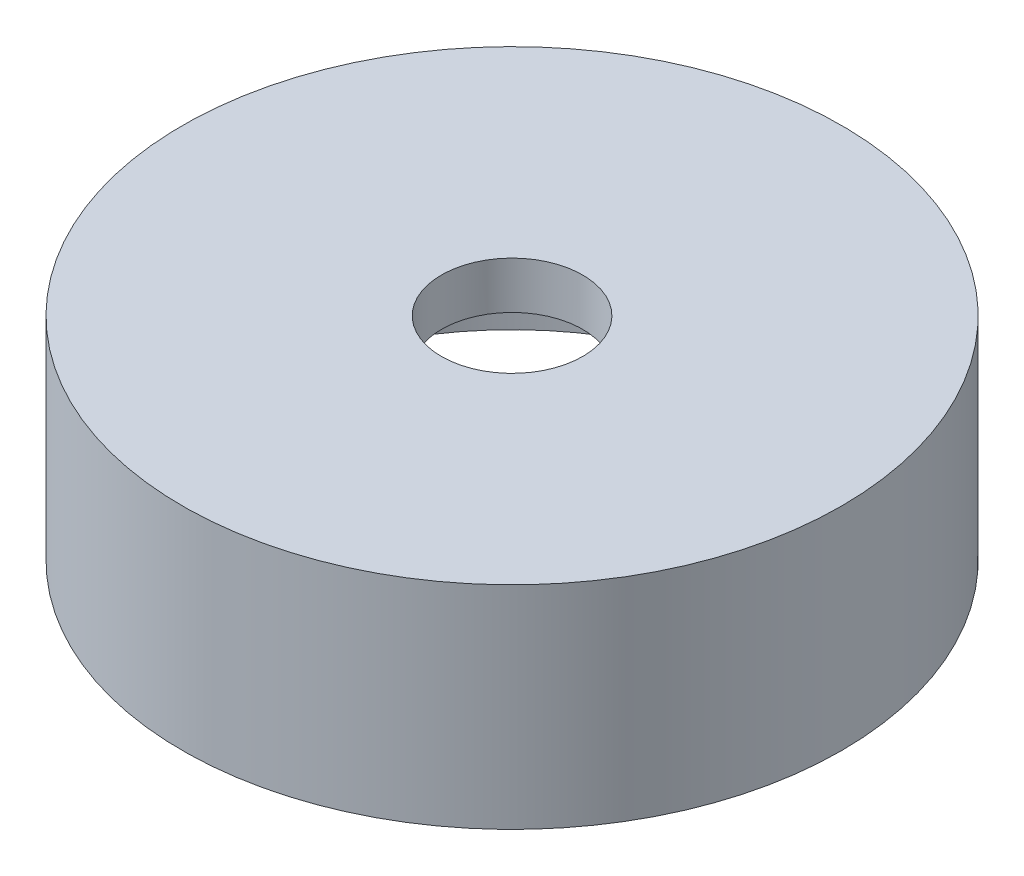
ISO-10303-21;
HEADER;
FILE_DESCRIPTION(('STEP AP214'),'2;1');
FILE_NAME('part.step','',(''),(''),'','','');
FILE_SCHEMA(('AUTOMOTIVE_DESIGN { 1 0 10303 214 1 1 1 1 }'));
ENDSEC;
DATA;
#1=APPLICATION_CONTEXT('core data for automotive mechanical design processes');
#2=APPLICATION_PROTOCOL_DEFINITION('international standard','automotive_design',2000,#1);
#3=PRODUCT_CONTEXT('',#1,'mechanical');
#4=PRODUCT('Part','Part','',(#3));
#5=PRODUCT_RELATED_PRODUCT_CATEGORY('part','',(#4));
#6=PRODUCT_DEFINITION_FORMATION('','',#4);
#7=PRODUCT_DEFINITION_CONTEXT('part definition',#1,'design');
#8=PRODUCT_DEFINITION('design','',#6,#7);
#9=PRODUCT_DEFINITION_SHAPE('','',#8);
#10=(LENGTH_UNIT() NAMED_UNIT(*) SI_UNIT(.MILLI.,.METRE.));
#11=(NAMED_UNIT(*) PLANE_ANGLE_UNIT() SI_UNIT($,.RADIAN.));
#12=(NAMED_UNIT(*) SI_UNIT($,.STERADIAN.) SOLID_ANGLE_UNIT());
#13=UNCERTAINTY_MEASURE_WITH_UNIT(LENGTH_MEASURE(1.E-05),#10,'distance_accuracy_value','');
#14=(GEOMETRIC_REPRESENTATION_CONTEXT(3) GLOBAL_UNCERTAINTY_ASSIGNED_CONTEXT((#13)) GLOBAL_UNIT_ASSIGNED_CONTEXT((#10,
#11,#12)) REPRESENTATION_CONTEXT('',''));
#15=CARTESIAN_POINT('',(0.,0.,0.));
#16=DIRECTION('',(0.,0.,1.));
#17=DIRECTION('',(1.,0.,0.));
#18=AXIS2_PLACEMENT_3D('',#15,#16,#17);
#19=CARTESIAN_POINT('',(0.,3.5,0.));
#20=DIRECTION('',(0.,-1.,0.));
#21=DIRECTION('',(1.,0.,0.));
#22=AXIS2_PLACEMENT_3D('',#19,#20,#21);
#23=PLANE('',#22);
#24=CARTESIAN_POINT('',(0.,3.5,0.));
#25=DIRECTION('',(0.,-1.,0.));
#26=DIRECTION('',(1.,0.,0.));
#27=AXIS2_PLACEMENT_3D('',#24,#25,#26);
#28=CIRCLE('',#27,1.5);
#29=CARTESIAN_POINT('',(1.5,3.5,0.));
#30=VERTEX_POINT('',#29);
#31=EDGE_CURVE('E62',#30,#30,#28,.T.);
#32=ORIENTED_EDGE('',*,*,#31,.F.);
#33=EDGE_LOOP('',(#32));
#34=FACE_BOUND('',#33,.T.);
#35=CARTESIAN_POINT('',(0.,3.5,0.));
#36=DIRECTION('',(0.,-1.,0.));
#37=DIRECTION('',(1.,0.,0.));
#38=AXIS2_PLACEMENT_3D('',#35,#36,#37);
#39=CIRCLE('',#38,6.);
#40=CARTESIAN_POINT('',(6.,3.5,0.));
#41=VERTEX_POINT('',#40);
#42=EDGE_CURVE('E10',#41,#41,#39,.T.);
#43=ORIENTED_EDGE('',*,*,#42,.T.);
#44=EDGE_LOOP('',(#43));
#45=FACE_BOUND('',#44,.T.);
#46=ADVANCED_FACE('F39',(#34,#45),#23,.T.);
#47=CARTESIAN_POINT('',(0.,0.,0.));
#48=DIRECTION('',(0.,-1.,0.));
#49=DIRECTION('',(1.,0.,0.));
#50=AXIS2_PLACEMENT_3D('',#47,#48,#49);
#51=CYLINDRICAL_SURFACE('',#50,6.);
#52=CARTESIAN_POINT('',(0.,0.,0.));
#53=DIRECTION('',(0.,-1.,0.));
#54=DIRECTION('',(1.,0.,0.));
#55=AXIS2_PLACEMENT_3D('',#52,#53,#54);
#56=CIRCLE('',#55,6.);
#57=CARTESIAN_POINT('',(6.,0.,0.));
#58=VERTEX_POINT('',#57);
#59=EDGE_CURVE('E46',#58,#58,#56,.T.);
#60=ORIENTED_EDGE('',*,*,#59,.T.);
#61=EDGE_LOOP('',(#60));
#62=FACE_BOUND('',#61,.T.);
#63=ORIENTED_EDGE('',*,*,#42,.F.);
#64=EDGE_LOOP('',(#63));
#65=FACE_BOUND('',#64,.T.);
#66=ADVANCED_FACE('F88',(#62,#65),#51,.F.);
#67=CARTESIAN_POINT('',(6.,0.,0.));
#68=DIRECTION('',(0.,-1.,0.));
#69=DIRECTION('',(1.,0.,0.));
#70=AXIS2_PLACEMENT_3D('',#67,#68,#69);
#71=PLANE('',#70);
#72=CARTESIAN_POINT('',(0.,0.,0.));
#73=DIRECTION('',(0.,-1.,0.));
#74=DIRECTION('',(1.,0.,0.));
#75=AXIS2_PLACEMENT_3D('',#72,#73,#74);
#76=CIRCLE('',#75,7.);
#77=CARTESIAN_POINT('',(7.,0.,0.));
#78=VERTEX_POINT('',#77);
#79=EDGE_CURVE('E51',#78,#78,#76,.T.);
#80=ORIENTED_EDGE('',*,*,#79,.T.);
#81=EDGE_LOOP('',(#80));
#82=FACE_BOUND('',#81,.T.);
#83=ORIENTED_EDGE('',*,*,#59,.F.);
#84=EDGE_LOOP('',(#83));
#85=FACE_BOUND('',#84,.T.);
#86=ADVANCED_FACE('F82',(#82,#85),#71,.T.);
#87=CARTESIAN_POINT('',(0.,0.,0.));
#88=DIRECTION('',(0.,-1.,0.));
#89=DIRECTION('',(1.,0.,0.));
#90=AXIS2_PLACEMENT_3D('',#87,#88,#89);
#91=CYLINDRICAL_SURFACE('',#90,7.);
#92=CARTESIAN_POINT('',(0.,4.5,0.));
#93=DIRECTION('',(0.,-1.,0.));
#94=DIRECTION('',(1.,0.,0.));
#95=AXIS2_PLACEMENT_3D('',#92,#93,#94);
#96=CIRCLE('',#95,7.);
#97=CARTESIAN_POINT('',(7.,4.5,0.));
#98=VERTEX_POINT('',#97);
#99=EDGE_CURVE('E56',#98,#98,#96,.T.);
#100=ORIENTED_EDGE('',*,*,#99,.T.);
#101=EDGE_LOOP('',(#100));
#102=FACE_BOUND('',#101,.T.);
#103=ORIENTED_EDGE('',*,*,#79,.F.);
#104=EDGE_LOOP('',(#103));
#105=FACE_BOUND('',#104,.T.);
#106=ADVANCED_FACE('F76',(#102,#105),#91,.T.);
#107=CARTESIAN_POINT('',(0.,4.5,0.));
#108=DIRECTION('',(0.,1.,0.));
#109=DIRECTION('',(-1.,0.,0.));
#110=AXIS2_PLACEMENT_3D('',#107,#108,#109);
#111=PLANE('',#110);
#112=CARTESIAN_POINT('',(0.,4.5,0.));
#113=DIRECTION('',(0.,1.,0.));
#114=DIRECTION('',(0.,0.,1.));
#115=AXIS2_PLACEMENT_3D('',#112,#113,#114);
#116=CIRCLE('',#115,1.5);
#117=CARTESIAN_POINT('',(0.,4.5,1.5));
#118=VERTEX_POINT('',#117);
#119=EDGE_CURVE('E66',#118,#118,#116,.T.);
#120=ORIENTED_EDGE('',*,*,#119,.F.);
#121=EDGE_LOOP('',(#120));
#122=FACE_BOUND('',#121,.T.);
#123=ORIENTED_EDGE('',*,*,#99,.F.);
#124=EDGE_LOOP('',(#123));
#125=FACE_BOUND('',#124,.T.);
#126=ADVANCED_FACE('F73',(#122,#125),#111,.T.);
#127=CARTESIAN_POINT('',(0.,4.5,0.));
#128=DIRECTION('',(0.,1.,0.));
#129=DIRECTION('',(0.,0.,1.));
#130=AXIS2_PLACEMENT_3D('',#127,#128,#129);
#131=CYLINDRICAL_SURFACE('',#130,1.5);
#132=ORIENTED_EDGE('',*,*,#31,.T.);
#133=EDGE_LOOP('',(#132));
#134=FACE_BOUND('',#133,.T.);
#135=ORIENTED_EDGE('',*,*,#119,.T.);
#136=EDGE_LOOP('',(#135));
#137=FACE_BOUND('',#136,.T.);
#138=ADVANCED_FACE('F71',(#134,#137),#131,.F.);
#139=CLOSED_SHELL('',(#46,#66,#86,#106,#126,#138));
#140=MANIFOLD_SOLID_BREP('B2',#139);
#141=ADVANCED_BREP_SHAPE_REPRESENTATION('',(#18,#140),#14);
#142=SHAPE_DEFINITION_REPRESENTATION(#9,#141);
ENDSEC;
END-ISO-10303-21;
